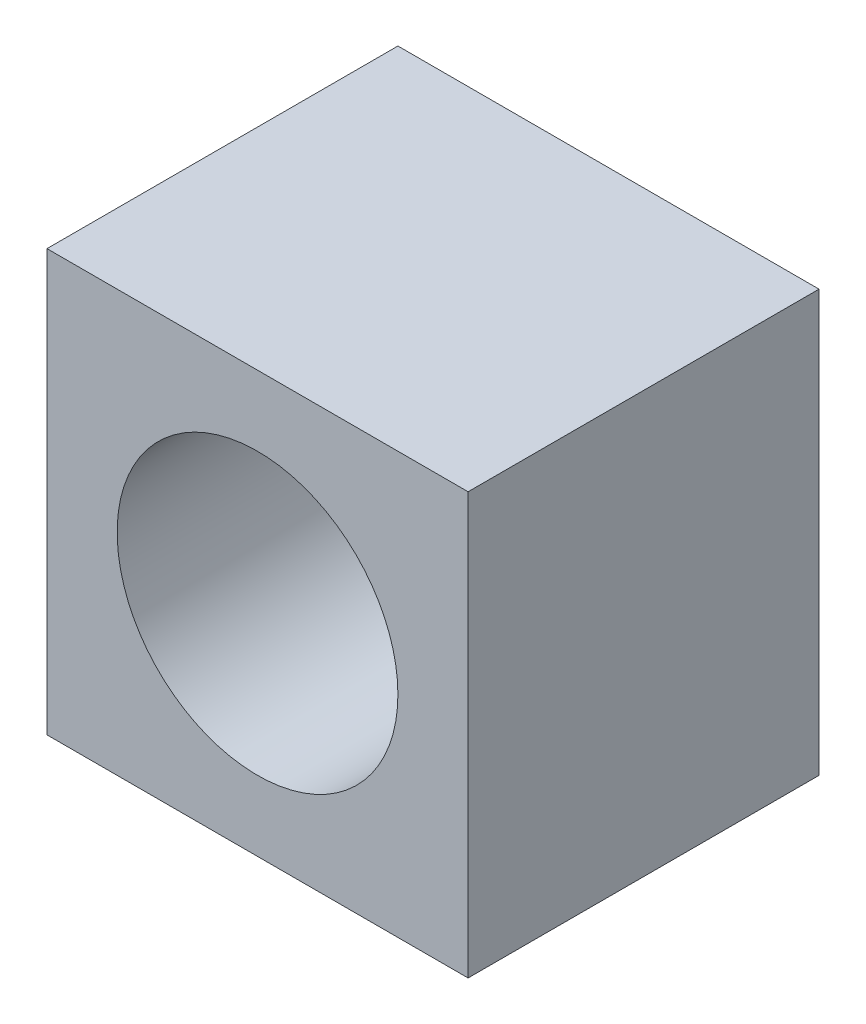
ISO-10303-21;
HEADER;
FILE_DESCRIPTION(('STEP AP214'),'2;1');
FILE_NAME('part.step','',(''),(''),'','','');
FILE_SCHEMA(('AUTOMOTIVE_DESIGN { 1 0 10303 214 1 1 1 1 }'));
ENDSEC;
DATA;
#1=APPLICATION_CONTEXT('core data for automotive mechanical design processes');
#2=APPLICATION_PROTOCOL_DEFINITION('international standard','automotive_design',2000,#1);
#3=PRODUCT_CONTEXT('',#1,'mechanical');
#4=PRODUCT('Part','Part','',(#3));
#5=PRODUCT_RELATED_PRODUCT_CATEGORY('part','',(#4));
#6=PRODUCT_DEFINITION_FORMATION('','',#4);
#7=PRODUCT_DEFINITION_CONTEXT('part definition',#1,'design');
#8=PRODUCT_DEFINITION('design','',#6,#7);
#9=PRODUCT_DEFINITION_SHAPE('','',#8);
#10=(LENGTH_UNIT() NAMED_UNIT(*) SI_UNIT(.MILLI.,.METRE.));
#11=(NAMED_UNIT(*) PLANE_ANGLE_UNIT() SI_UNIT($,.RADIAN.));
#12=(NAMED_UNIT(*) SI_UNIT($,.STERADIAN.) SOLID_ANGLE_UNIT());
#13=UNCERTAINTY_MEASURE_WITH_UNIT(LENGTH_MEASURE(1.E-05),#10,'distance_accuracy_value','');
#14=(GEOMETRIC_REPRESENTATION_CONTEXT(3) GLOBAL_UNCERTAINTY_ASSIGNED_CONTEXT((#13)) GLOBAL_UNIT_ASSIGNED_CONTEXT((#10,
#11,#12)) REPRESENTATION_CONTEXT('',''));
#15=CARTESIAN_POINT('',(0.,0.,0.));
#16=DIRECTION('',(0.,0.,1.));
#17=DIRECTION('',(1.,0.,0.));
#18=AXIS2_PLACEMENT_3D('',#15,#16,#17);
#19=CARTESIAN_POINT('',(6.,6.,10.));
#20=DIRECTION('',(-1.,0.,0.));
#21=DIRECTION('',(0.,0.,1.));
#22=AXIS2_PLACEMENT_3D('',#19,#20,#21);
#23=PLANE('',#22);
#24=DIRECTION('',(0.,1.,0.));
#25=VECTOR('',#24,1.);
#26=CARTESIAN_POINT('',(6.,6.,0.));
#27=LINE('',#26,#25);
#28=CARTESIAN_POINT('',(6.,-6.,0.));
#29=VERTEX_POINT('',#28);
#30=CARTESIAN_POINT('',(6.,6.,0.));
#31=VERTEX_POINT('',#30);
#32=EDGE_CURVE('E96',#29,#31,#27,.T.);
#33=ORIENTED_EDGE('',*,*,#32,.T.);
#34=DIRECTION('',(0.,0.,-1.));
#35=VECTOR('',#34,1.);
#36=CARTESIAN_POINT('',(6.,6.,10.));
#37=LINE('',#36,#35);
#38=CARTESIAN_POINT('',(6.,6.,10.));
#39=VERTEX_POINT('',#38);
#40=EDGE_CURVE('E11',#39,#31,#37,.T.);
#41=ORIENTED_EDGE('',*,*,#40,.F.);
#42=DIRECTION('',(0.,1.,0.));
#43=VECTOR('',#42,1.);
#44=CARTESIAN_POINT('',(6.,6.,10.));
#45=LINE('',#44,#43);
#46=CARTESIAN_POINT('',(6.,-6.,10.));
#47=VERTEX_POINT('',#46);
#48=EDGE_CURVE('E84',#47,#39,#45,.T.);
#49=ORIENTED_EDGE('',*,*,#48,.F.);
#50=DIRECTION('',(0.,0.,-1.));
#51=VECTOR('',#50,1.);
#52=CARTESIAN_POINT('',(6.,-6.,10.));
#53=LINE('',#52,#51);
#54=EDGE_CURVE('E92',#47,#29,#53,.T.);
#55=ORIENTED_EDGE('',*,*,#54,.T.);
#56=EDGE_LOOP('',(#33,#41,#49,#55));
#57=FACE_BOUND('',#56,.T.);
#58=ADVANCED_FACE('F33',(#57),#23,.F.);
#59=CARTESIAN_POINT('',(-6.,6.,10.));
#60=DIRECTION('',(0.,-1.,0.));
#61=DIRECTION('',(0.,0.,-1.));
#62=AXIS2_PLACEMENT_3D('',#59,#60,#61);
#63=PLANE('',#62);
#64=DIRECTION('',(-1.,0.,0.));
#65=VECTOR('',#64,1.);
#66=CARTESIAN_POINT('',(-6.,6.,0.));
#67=LINE('',#66,#65);
#68=CARTESIAN_POINT('',(-6.,6.,0.));
#69=VERTEX_POINT('',#68);
#70=EDGE_CURVE('E88',#31,#69,#67,.T.);
#71=ORIENTED_EDGE('',*,*,#70,.T.);
#72=DIRECTION('',(0.,0.,-1.));
#73=VECTOR('',#72,1.);
#74=CARTESIAN_POINT('',(-6.,6.,10.));
#75=LINE('',#74,#73);
#76=CARTESIAN_POINT('',(-6.,6.,10.));
#77=VERTEX_POINT('',#76);
#78=EDGE_CURVE('E41',#77,#69,#75,.T.);
#79=ORIENTED_EDGE('',*,*,#78,.F.);
#80=DIRECTION('',(-1.,0.,0.));
#81=VECTOR('',#80,1.);
#82=CARTESIAN_POINT('',(-6.,6.,10.));
#83=LINE('',#82,#81);
#84=EDGE_CURVE('E79',#39,#77,#83,.T.);
#85=ORIENTED_EDGE('',*,*,#84,.F.);
#86=ORIENTED_EDGE('',*,*,#40,.T.);
#87=EDGE_LOOP('',(#71,#79,#85,#86));
#88=FACE_BOUND('',#87,.T.);
#89=ADVANCED_FACE('F87',(#88),#63,.F.);
#90=CARTESIAN_POINT('',(-6.,6.,10.));
#91=DIRECTION('',(1.,0.,0.));
#92=DIRECTION('',(0.,0.,-1.));
#93=AXIS2_PLACEMENT_3D('',#90,#91,#92);
#94=PLANE('',#93);
#95=DIRECTION('',(0.,-1.,0.));
#96=VECTOR('',#95,1.);
#97=CARTESIAN_POINT('',(-6.,6.,0.));
#98=LINE('',#97,#96);
#99=CARTESIAN_POINT('',(-6.,-6.,0.));
#100=VERTEX_POINT('',#99);
#101=EDGE_CURVE('E66',#69,#100,#98,.T.);
#102=ORIENTED_EDGE('',*,*,#101,.T.);
#103=DIRECTION('',(0.,0.,-1.));
#104=VECTOR('',#103,1.);
#105=CARTESIAN_POINT('',(-6.,-6.,10.));
#106=LINE('',#105,#104);
#107=CARTESIAN_POINT('',(-6.,-6.,10.));
#108=VERTEX_POINT('',#107);
#109=EDGE_CURVE('E89',#108,#100,#106,.T.);
#110=ORIENTED_EDGE('',*,*,#109,.F.);
#111=DIRECTION('',(0.,-1.,0.));
#112=VECTOR('',#111,1.);
#113=CARTESIAN_POINT('',(-6.,6.,10.));
#114=LINE('',#113,#112);
#115=EDGE_CURVE('E82',#77,#108,#114,.T.);
#116=ORIENTED_EDGE('',*,*,#115,.F.);
#117=ORIENTED_EDGE('',*,*,#78,.T.);
#118=EDGE_LOOP('',(#102,#110,#116,#117));
#119=FACE_BOUND('',#118,.T.);
#120=ADVANCED_FACE('F90',(#119),#94,.F.);
#121=CARTESIAN_POINT('',(-6.,-6.,10.));
#122=DIRECTION('',(0.,1.,0.));
#123=DIRECTION('',(0.,0.,1.));
#124=AXIS2_PLACEMENT_3D('',#121,#122,#123);
#125=PLANE('',#124);
#126=DIRECTION('',(1.,0.,0.));
#127=VECTOR('',#126,1.);
#128=CARTESIAN_POINT('',(-6.,-6.,0.));
#129=LINE('',#128,#127);
#130=EDGE_CURVE('E72',#100,#29,#129,.T.);
#131=ORIENTED_EDGE('',*,*,#130,.T.);
#132=ORIENTED_EDGE('',*,*,#54,.F.);
#133=DIRECTION('',(1.,0.,0.));
#134=VECTOR('',#133,1.);
#135=CARTESIAN_POINT('',(-6.,-6.,10.));
#136=LINE('',#135,#134);
#137=EDGE_CURVE('E49',#108,#47,#136,.T.);
#138=ORIENTED_EDGE('',*,*,#137,.F.);
#139=ORIENTED_EDGE('',*,*,#109,.T.);
#140=EDGE_LOOP('',(#131,#132,#138,#139));
#141=FACE_BOUND('',#140,.T.);
#142=ADVANCED_FACE('F104',(#141),#125,.F.);
#143=CARTESIAN_POINT('',(0.,0.,10.));
#144=DIRECTION('',(0.,0.,1.));
#145=DIRECTION('',(1.,0.,0.));
#146=AXIS2_PLACEMENT_3D('',#143,#144,#145);
#147=PLANE('',#146);
#148=CARTESIAN_POINT('',(0.,0.,10.));
#149=DIRECTION('',(0.,0.,1.));
#150=DIRECTION('',(1.,0.,0.));
#151=AXIS2_PLACEMENT_3D('',#148,#149,#150);
#152=CIRCLE('',#151,4.);
#153=CARTESIAN_POINT('',(4.,0.,10.));
#154=VERTEX_POINT('',#153);
#155=EDGE_CURVE('E110',#154,#154,#152,.T.);
#156=ORIENTED_EDGE('',*,*,#155,.F.);
#157=EDGE_LOOP('',(#156));
#158=FACE_BOUND('',#157,.T.);
#159=ORIENTED_EDGE('',*,*,#48,.T.);
#160=ORIENTED_EDGE('',*,*,#84,.T.);
#161=ORIENTED_EDGE('',*,*,#115,.T.);
#162=ORIENTED_EDGE('',*,*,#137,.T.);
#163=EDGE_LOOP('',(#159,#160,#161,#162));
#164=FACE_BOUND('',#163,.T.);
#165=ADVANCED_FACE('F80',(#158,#164),#147,.T.);
#166=CARTESIAN_POINT('',(0.,0.,0.));
#167=DIRECTION('',(0.,0.,1.));
#168=DIRECTION('',(1.,0.,0.));
#169=AXIS2_PLACEMENT_3D('',#166,#167,#168);
#170=PLANE('',#169);
#171=ORIENTED_EDGE('',*,*,#32,.F.);
#172=ORIENTED_EDGE('',*,*,#130,.F.);
#173=ORIENTED_EDGE('',*,*,#101,.F.);
#174=ORIENTED_EDGE('',*,*,#70,.F.);
#175=EDGE_LOOP('',(#171,#172,#173,#174));
#176=FACE_BOUND('',#175,.T.);
#177=ADVANCED_FACE('F107',(#176),#170,.F.);
#178=CARTESIAN_POINT('',(0.,0.,2.));
#179=DIRECTION('',(0.,0.,1.));
#180=DIRECTION('',(1.,0.,0.));
#181=AXIS2_PLACEMENT_3D('',#178,#179,#180);
#182=CYLINDRICAL_SURFACE('',#181,4.);
#183=CARTESIAN_POINT('',(0.,0.,2.));
#184=DIRECTION('',(0.,0.,1.));
#185=DIRECTION('',(1.,0.,0.));
#186=AXIS2_PLACEMENT_3D('',#183,#184,#185);
#187=CIRCLE('',#186,4.);
#188=CARTESIAN_POINT('',(4.,0.,2.));
#189=VERTEX_POINT('',#188);
#190=EDGE_CURVE('E99',#189,#189,#187,.T.);
#191=ORIENTED_EDGE('',*,*,#190,.F.);
#192=EDGE_LOOP('',(#191));
#193=FACE_BOUND('',#192,.T.);
#194=ORIENTED_EDGE('',*,*,#155,.T.);
#195=EDGE_LOOP('',(#194));
#196=FACE_BOUND('',#195,.T.);
#197=ADVANCED_FACE('F118',(#193,#196),#182,.F.);
#198=CARTESIAN_POINT('',(0.,0.,2.));
#199=DIRECTION('',(0.,0.,1.));
#200=DIRECTION('',(1.,0.,0.));
#201=AXIS2_PLACEMENT_3D('',#198,#199,#200);
#202=PLANE('',#201);
#203=ORIENTED_EDGE('',*,*,#190,.T.);
#204=EDGE_LOOP('',(#203));
#205=FACE_BOUND('',#204,.T.);
#206=ADVANCED_FACE('F116',(#205),#202,.T.);
#207=CLOSED_SHELL('',(#58,#89,#120,#142,#165,#177,#197,#206));
#208=MANIFOLD_SOLID_BREP('B2',#207);
#209=ADVANCED_BREP_SHAPE_REPRESENTATION('',(#18,#208),#14);
#210=SHAPE_DEFINITION_REPRESENTATION(#9,#209);
ENDSEC;
END-ISO-10303-21;
